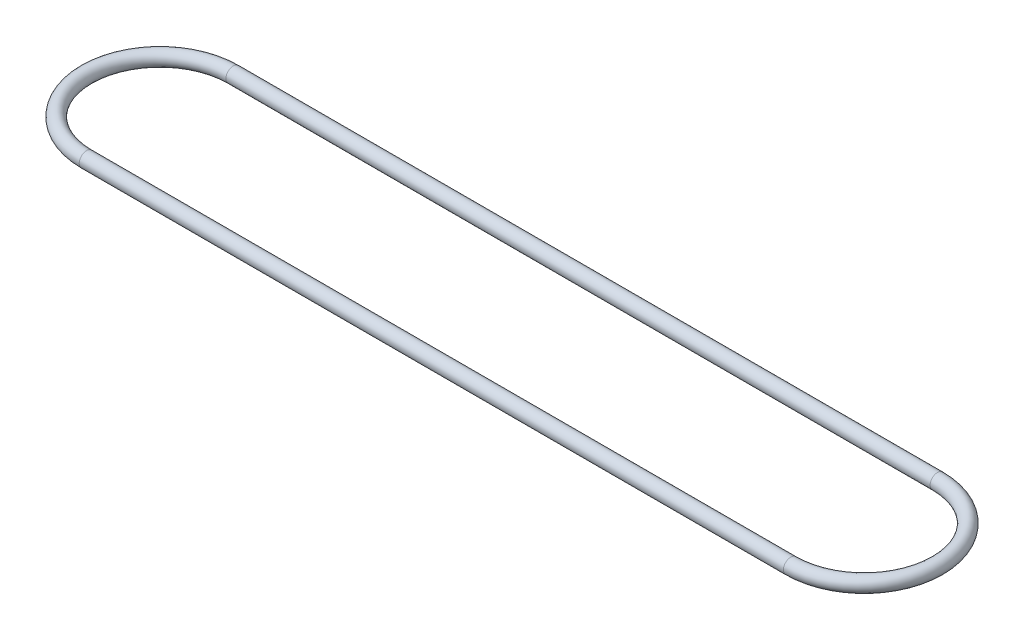
ISO-10303-21;
HEADER;
FILE_DESCRIPTION(('STEP AP214'),'2;1');
FILE_NAME('part.step','',(''),(''),'','','');
FILE_SCHEMA(('AUTOMOTIVE_DESIGN { 1 0 10303 214 1 1 1 1 }'));
ENDSEC;
DATA;
#1=APPLICATION_CONTEXT('core data for automotive mechanical design processes');
#2=APPLICATION_PROTOCOL_DEFINITION('international standard','automotive_design',2000,#1);
#3=PRODUCT_CONTEXT('',#1,'mechanical');
#4=PRODUCT('Part','Part','',(#3));
#5=PRODUCT_RELATED_PRODUCT_CATEGORY('part','',(#4));
#6=PRODUCT_DEFINITION_FORMATION('','',#4);
#7=PRODUCT_DEFINITION_CONTEXT('part definition',#1,'design');
#8=PRODUCT_DEFINITION('design','',#6,#7);
#9=PRODUCT_DEFINITION_SHAPE('','',#8);
#10=(LENGTH_UNIT() NAMED_UNIT(*) SI_UNIT(.MILLI.,.METRE.));
#11=(NAMED_UNIT(*) PLANE_ANGLE_UNIT() SI_UNIT($,.RADIAN.));
#12=(NAMED_UNIT(*) SI_UNIT($,.STERADIAN.) SOLID_ANGLE_UNIT());
#13=UNCERTAINTY_MEASURE_WITH_UNIT(LENGTH_MEASURE(1.E-05),#10,'distance_accuracy_value','');
#14=(GEOMETRIC_REPRESENTATION_CONTEXT(3) GLOBAL_UNCERTAINTY_ASSIGNED_CONTEXT((#13)) GLOBAL_UNIT_ASSIGNED_CONTEXT((#10,
#11,#12)) REPRESENTATION_CONTEXT('',''));
#15=CARTESIAN_POINT('',(0.,0.,0.));
#16=DIRECTION('',(0.,0.,1.));
#17=DIRECTION('',(1.,0.,0.));
#18=AXIS2_PLACEMENT_3D('',#15,#16,#17);
#19=CARTESIAN_POINT('',(0.,0.,-31.75));
#20=DIRECTION('',(0.,-1.,0.));
#21=DIRECTION('',(0.,0.,-1.));
#22=AXIS2_PLACEMENT_3D('',#19,#20,#21);
#23=TOROIDAL_SURFACE('',#22,31.75,3.175);
#24=CARTESIAN_POINT('',(0.,0.,0.));
#25=DIRECTION('',(1.,0.,0.));
#26=DIRECTION('',(0.,0.,-1.));
#27=AXIS2_PLACEMENT_3D('',#24,#25,#26);
#28=CIRCLE('',#27,3.175);
#29=CARTESIAN_POINT('',(0.,0.,3.175));
#30=VERTEX_POINT('',#29);
#31=EDGE_CURVE('E46',#30,#30,#28,.T.);
#32=CARTESIAN_POINT('',(0.,0.,-63.5));
#33=DIRECTION('',(-1.,0.,0.));
#34=DIRECTION('',(0.,0.,1.));
#35=AXIS2_PLACEMENT_3D('',#32,#33,#34);
#36=CIRCLE('',#35,3.175);
#37=CARTESIAN_POINT('',(0.,0.,-66.675));
#38=VERTEX_POINT('',#37);
#39=EDGE_CURVE('E42',#38,#38,#36,.T.);
#40=CARTESIAN_POINT('',(0.,0.,-31.75));
#41=DIRECTION('',(0.,-1.,0.));
#42=DIRECTION('',(0.,0.,-1.));
#43=AXIS2_PLACEMENT_3D('',#40,#41,#42);
#44=CIRCLE('',#43,34.925);
#45=EDGE_CURVE('',#30,#38,#44,.T.);
#46=ORIENTED_EDGE('',*,*,#31,.F.);
#47=ORIENTED_EDGE('',*,*,#39,.T.);
#48=ORIENTED_EDGE('',*,*,#45,.T.);
#49=ORIENTED_EDGE('',*,*,#45,.F.);
#50=EDGE_LOOP('',(#46,#48,#47,#49));
#51=FACE_BOUND('',#50,.T.);
#52=ADVANCED_FACE('F31',(#51),#23,.T.);
#53=CARTESIAN_POINT('',(0.,0.,-63.5));
#54=DIRECTION('',(1.,0.,0.));
#55=DIRECTION('',(0.,0.,-1.));
#56=AXIS2_PLACEMENT_3D('',#53,#54,#55);
#57=CYLINDRICAL_SURFACE('',#56,3.175);
#58=CARTESIAN_POINT('',(304.8,0.,-63.5));
#59=DIRECTION('',(-1.,0.,0.));
#60=DIRECTION('',(0.,0.,1.));
#61=AXIS2_PLACEMENT_3D('',#58,#59,#60);
#62=CIRCLE('',#61,3.175);
#63=CARTESIAN_POINT('',(304.8,0.,-66.675));
#64=VERTEX_POINT('',#63);
#65=EDGE_CURVE('E38',#64,#64,#62,.T.);
#66=ORIENTED_EDGE('',*,*,#65,.T.);
#67=EDGE_LOOP('',(#66));
#68=FACE_BOUND('',#67,.T.);
#69=ORIENTED_EDGE('',*,*,#39,.F.);
#70=EDGE_LOOP('',(#69));
#71=FACE_BOUND('',#70,.T.);
#72=ADVANCED_FACE('F55',(#68,#71),#57,.T.);
#73=CARTESIAN_POINT('',(304.8,0.,-31.75));
#74=DIRECTION('',(0.,-1.,0.));
#75=DIRECTION('',(0.,0.,-1.));
#76=AXIS2_PLACEMENT_3D('',#73,#74,#75);
#77=TOROIDAL_SURFACE('',#76,31.75,3.175);
#78=CARTESIAN_POINT('',(304.8,0.,0.));
#79=DIRECTION('',(1.,0.,0.));
#80=DIRECTION('',(0.,0.,-1.));
#81=AXIS2_PLACEMENT_3D('',#78,#79,#80);
#82=CIRCLE('',#81,3.175);
#83=CARTESIAN_POINT('',(304.8,0.,3.175));
#84=VERTEX_POINT('',#83);
#85=EDGE_CURVE('E10',#84,#84,#82,.T.);
#86=CARTESIAN_POINT('',(304.8,0.,-31.75));
#87=DIRECTION('',(0.,-1.,0.));
#88=DIRECTION('',(0.,0.,-1.));
#89=AXIS2_PLACEMENT_3D('',#86,#87,#88);
#90=CIRCLE('',#89,34.925);
#91=EDGE_CURVE('',#64,#84,#90,.T.);
#92=ORIENTED_EDGE('',*,*,#65,.F.);
#93=ORIENTED_EDGE('',*,*,#85,.T.);
#94=ORIENTED_EDGE('',*,*,#91,.T.);
#95=ORIENTED_EDGE('',*,*,#91,.F.);
#96=EDGE_LOOP('',(#92,#94,#93,#95));
#97=FACE_BOUND('',#96,.T.);
#98=ADVANCED_FACE('F61',(#97),#77,.T.);
#99=CARTESIAN_POINT('',(304.8,0.,0.));
#100=DIRECTION('',(-1.,0.,0.));
#101=DIRECTION('',(0.,0.,1.));
#102=AXIS2_PLACEMENT_3D('',#99,#100,#101);
#103=CYLINDRICAL_SURFACE('',#102,3.175);
#104=ORIENTED_EDGE('',*,*,#31,.T.);
#105=EDGE_LOOP('',(#104));
#106=FACE_BOUND('',#105,.T.);
#107=ORIENTED_EDGE('',*,*,#85,.F.);
#108=EDGE_LOOP('',(#107));
#109=FACE_BOUND('',#108,.T.);
#110=ADVANCED_FACE('F33',(#106,#109),#103,.T.);
#111=CLOSED_SHELL('',(#52,#72,#98,#110));
#112=MANIFOLD_SOLID_BREP('B2',#111);
#113=ADVANCED_BREP_SHAPE_REPRESENTATION('',(#18,#112),#14);
#114=SHAPE_DEFINITION_REPRESENTATION(#9,#113);
ENDSEC;
END-ISO-10303-21;
